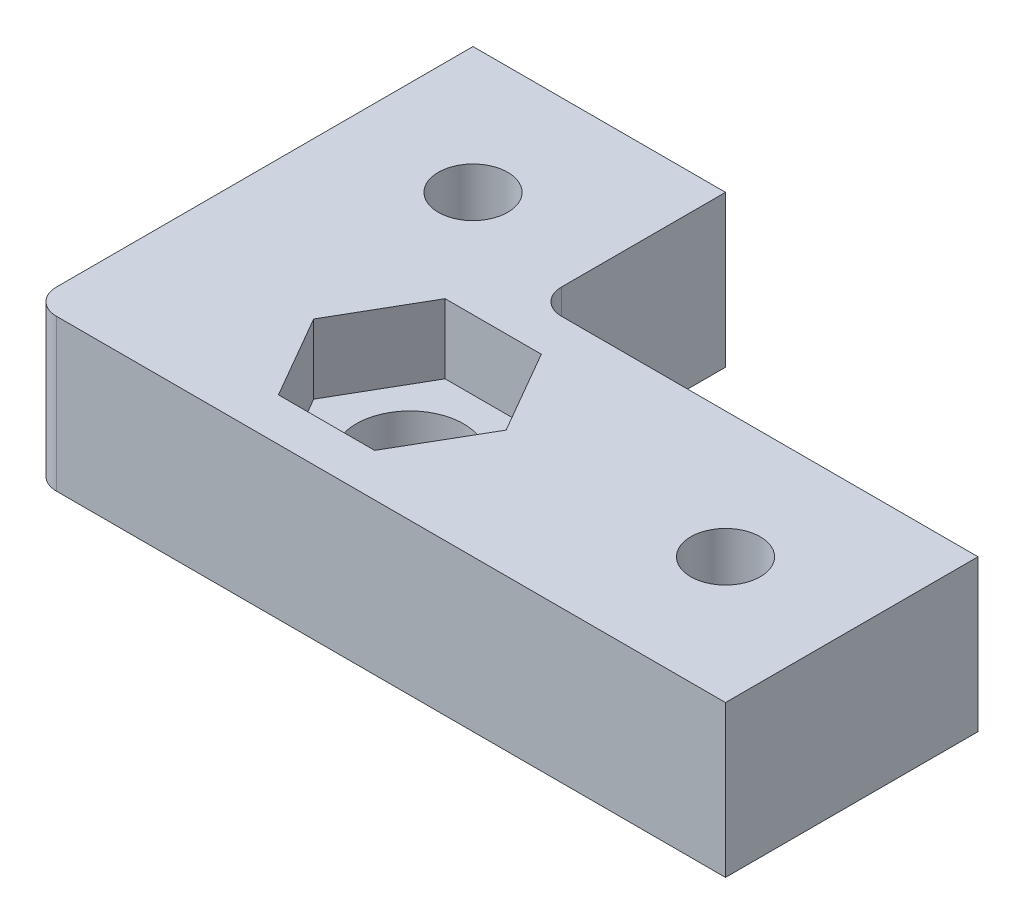
ISO-10303-21;
HEADER;
FILE_DESCRIPTION(('STEP AP214'),'2;1');
FILE_NAME('part.step','',(''),(''),'','','');
FILE_SCHEMA(('AUTOMOTIVE_DESIGN { 1 0 10303 214 1 1 1 1 }'));
ENDSEC;
DATA;
#1=APPLICATION_CONTEXT('core data for automotive mechanical design processes');
#2=APPLICATION_PROTOCOL_DEFINITION('international standard','automotive_design',2000,#1);
#3=PRODUCT_CONTEXT('',#1,'mechanical');
#4=PRODUCT('Part','Part','',(#3));
#5=PRODUCT_RELATED_PRODUCT_CATEGORY('part','',(#4));
#6=PRODUCT_DEFINITION_FORMATION('','',#4);
#7=PRODUCT_DEFINITION_CONTEXT('part definition',#1,'design');
#8=PRODUCT_DEFINITION('design','',#6,#7);
#9=PRODUCT_DEFINITION_SHAPE('','',#8);
#10=(LENGTH_UNIT() NAMED_UNIT(*) SI_UNIT(.MILLI.,.METRE.));
#11=(NAMED_UNIT(*) PLANE_ANGLE_UNIT() SI_UNIT($,.RADIAN.));
#12=(NAMED_UNIT(*) SI_UNIT($,.STERADIAN.) SOLID_ANGLE_UNIT());
#13=UNCERTAINTY_MEASURE_WITH_UNIT(LENGTH_MEASURE(1.E-05),#10,'distance_accuracy_value','');
#14=(GEOMETRIC_REPRESENTATION_CONTEXT(3) GLOBAL_UNCERTAINTY_ASSIGNED_CONTEXT((#13)) GLOBAL_UNIT_ASSIGNED_CONTEXT((#10,
#11,#12)) REPRESENTATION_CONTEXT('',''));
#15=CARTESIAN_POINT('',(0.,0.,0.));
#16=DIRECTION('',(0.,0.,1.));
#17=DIRECTION('',(1.,0.,0.));
#18=AXIS2_PLACEMENT_3D('',#15,#16,#17);
#19=CARTESIAN_POINT('',(0.,12.,0.));
#20=DIRECTION('',(0.,-1.,0.));
#21=DIRECTION('',(0.,0.,-1.));
#22=AXIS2_PLACEMENT_3D('',#19,#20,#21);
#23=PLANE('',#22);
#24=CARTESIAN_POINT('',(50.,12.,-15.));
#25=DIRECTION('',(0.,1.,0.));
#26=DIRECTION('',(0.,0.,1.));
#27=AXIS2_PLACEMENT_3D('',#24,#25,#26);
#28=CIRCLE('',#27,2.75);
#29=CARTESIAN_POINT('',(50.,12.,-12.25));
#30=VERTEX_POINT('',#29);
#31=EDGE_CURVE('E367',#30,#30,#28,.T.);
#32=ORIENTED_EDGE('',*,*,#31,.F.);
#33=EDGE_LOOP('',(#32));
#34=FACE_BOUND('',#33,.T.);
#35=CARTESIAN_POINT('',(15.,12.,-30.));
#36=DIRECTION('',(0.,1.,0.));
#37=DIRECTION('',(0.,0.,1.));
#38=AXIS2_PLACEMENT_3D('',#35,#36,#37);
#39=CIRCLE('',#38,2.75);
#40=CARTESIAN_POINT('',(15.,12.,-27.25));
#41=VERTEX_POINT('',#40);
#42=EDGE_CURVE('E164',#41,#41,#39,.T.);
#43=ORIENTED_EDGE('',*,*,#42,.F.);
#44=EDGE_LOOP('',(#43));
#45=FACE_BOUND('',#44,.T.);
#46=DIRECTION('',(-0.5,0.,-0.866025403784439));
#47=VECTOR('',#46,1.);
#48=CARTESIAN_POINT('',(32.6210235533031,12.,-15.));
#49=LINE('',#48,#47);
#50=CARTESIAN_POINT('',(32.6210235533031,12.,-15.));
#51=VERTEX_POINT('',#50);
#52=CARTESIAN_POINT('',(28.8105117766515,12.,-21.6));
#53=VERTEX_POINT('',#52);
#54=EDGE_CURVE('E200',#51,#53,#49,.T.);
#55=ORIENTED_EDGE('',*,*,#54,.F.);
#56=DIRECTION('',(0.499999999999999,0.,-0.866025403784439));
#57=VECTOR('',#56,1.);
#58=CARTESIAN_POINT('',(28.8105117766515,12.,-8.39999999999999));
#59=LINE('',#58,#57);
#60=CARTESIAN_POINT('',(28.8105117766515,12.,-8.39999999999999));
#61=VERTEX_POINT('',#60);
#62=EDGE_CURVE('E178',#61,#51,#59,.T.);
#63=ORIENTED_EDGE('',*,*,#62,.F.);
#64=DIRECTION('',(1.,0.,0.));
#65=VECTOR('',#64,1.);
#66=CARTESIAN_POINT('',(21.1894882233485,12.,-8.39999999999999));
#67=LINE('',#66,#65);
#68=CARTESIAN_POINT('',(21.1894882233485,12.,-8.39999999999999));
#69=VERTEX_POINT('',#68);
#70=EDGE_CURVE('E183',#69,#61,#67,.T.);
#71=ORIENTED_EDGE('',*,*,#70,.F.);
#72=DIRECTION('',(0.5,0.,0.866025403784438));
#73=VECTOR('',#72,1.);
#74=CARTESIAN_POINT('',(17.3789764466969,12.,-15.));
#75=LINE('',#74,#73);
#76=CARTESIAN_POINT('',(17.3789764466969,12.,-15.));
#77=VERTEX_POINT('',#76);
#78=EDGE_CURVE('E209',#77,#69,#75,.T.);
#79=ORIENTED_EDGE('',*,*,#78,.F.);
#80=DIRECTION('',(-0.499999999999999,0.,0.866025403784439));
#81=VECTOR('',#80,1.);
#82=CARTESIAN_POINT('',(21.1894882233485,12.,-21.6));
#83=LINE('',#82,#81);
#84=CARTESIAN_POINT('',(21.1894882233485,12.,-21.6));
#85=VERTEX_POINT('',#84);
#86=EDGE_CURVE('E206',#85,#77,#83,.T.);
#87=ORIENTED_EDGE('',*,*,#86,.F.);
#88=DIRECTION('',(-1.,0.,0.));
#89=VECTOR('',#88,1.);
#90=CARTESIAN_POINT('',(28.8105117766515,12.,-21.6));
#91=LINE('',#90,#89);
#92=EDGE_CURVE('E203',#53,#85,#91,.T.);
#93=ORIENTED_EDGE('',*,*,#92,.F.);
#94=EDGE_LOOP('',(#55,#63,#71,#79,#87,#93));
#95=FACE_BOUND('',#94,.T.);
#96=DIRECTION('',(0.,0.,1.));
#97=VECTOR('',#96,1.);
#98=CARTESIAN_POINT('',(5.00000000000001,12.,-40.));
#99=LINE('',#98,#97);
#100=CARTESIAN_POINT('',(5.00000000000001,12.,-40.));
#101=VERTEX_POINT('',#100);
#102=CARTESIAN_POINT('',(5.00000000000001,12.,-7.));
#103=VERTEX_POINT('',#102);
#104=EDGE_CURVE('E151',#101,#103,#99,.T.);
#105=ORIENTED_EDGE('',*,*,#104,.T.);
#106=CARTESIAN_POINT('',(7.00000000000001,12.,-7.));
#107=DIRECTION('',(0.,-1.,0.));
#108=DIRECTION('',(0.,0.,-1.));
#109=AXIS2_PLACEMENT_3D('',#106,#107,#108);
#110=CIRCLE('',#109,2.);
#111=CARTESIAN_POINT('',(7.00000000000001,12.,-5.));
#112=VERTEX_POINT('',#111);
#113=EDGE_CURVE('E55',#103,#112,#110,.F.);
#114=ORIENTED_EDGE('',*,*,#113,.T.);
#115=DIRECTION('',(1.,0.,0.));
#116=VECTOR('',#115,1.);
#117=CARTESIAN_POINT('',(5.00000000000001,12.,-5.));
#118=LINE('',#117,#116);
#119=CARTESIAN_POINT('',(60.,12.,-5.));
#120=VERTEX_POINT('',#119);
#121=EDGE_CURVE('E169',#112,#120,#118,.T.);
#122=ORIENTED_EDGE('',*,*,#121,.T.);
#123=DIRECTION('',(0.,0.,-1.));
#124=VECTOR('',#123,1.);
#125=CARTESIAN_POINT('',(60.,12.,-5.));
#126=LINE('',#125,#124);
#127=CARTESIAN_POINT('',(60.,12.,-25.));
#128=VERTEX_POINT('',#127);
#129=EDGE_CURVE('E161',#120,#128,#126,.T.);
#130=ORIENTED_EDGE('',*,*,#129,.T.);
#131=DIRECTION('',(-1.,0.,0.));
#132=VECTOR('',#131,1.);
#133=CARTESIAN_POINT('',(25.,12.,-25.));
#134=LINE('',#133,#132);
#135=CARTESIAN_POINT('',(27.,12.,-25.));
#136=VERTEX_POINT('',#135);
#137=EDGE_CURVE('E231',#128,#136,#134,.T.);
#138=ORIENTED_EDGE('',*,*,#137,.T.);
#139=CARTESIAN_POINT('',(27.,12.,-27.));
#140=DIRECTION('',(0.,-1.,0.));
#141=DIRECTION('',(0.,0.,-1.));
#142=AXIS2_PLACEMENT_3D('',#139,#140,#141);
#143=CIRCLE('',#142,2.);
#144=CARTESIAN_POINT('',(25.,12.,-27.));
#145=VERTEX_POINT('',#144);
#146=EDGE_CURVE('E250',#136,#145,#143,.T.);
#147=ORIENTED_EDGE('',*,*,#146,.T.);
#148=DIRECTION('',(0.,0.,-1.));
#149=VECTOR('',#148,1.);
#150=CARTESIAN_POINT('',(25.,12.,-65.));
#151=LINE('',#150,#149);
#152=CARTESIAN_POINT('',(25.,12.,-40.));
#153=VERTEX_POINT('',#152);
#154=EDGE_CURVE('E233',#145,#153,#151,.T.);
#155=ORIENTED_EDGE('',*,*,#154,.T.);
#156=DIRECTION('',(-1.,0.,0.));
#157=VECTOR('',#156,1.);
#158=CARTESIAN_POINT('',(60.,12.,-40.));
#159=LINE('',#158,#157);
#160=EDGE_CURVE('E158',#153,#101,#159,.T.);
#161=ORIENTED_EDGE('',*,*,#160,.T.);
#162=EDGE_LOOP('',(#105,#114,#122,#130,#138,#147,#155,#161));
#163=FACE_BOUND('',#162,.T.);
#164=ADVANCED_FACE('F33',(#34,#45,#95,#163),#23,.F.);
#165=CARTESIAN_POINT('',(25.,12.,-25.));
#166=DIRECTION('',(0.,0.,1.));
#167=DIRECTION('',(1.,0.,0.));
#168=AXIS2_PLACEMENT_3D('',#165,#166,#167);
#169=PLANE('',#168);
#170=DIRECTION('',(0.,1.,0.));
#171=VECTOR('',#170,1.);
#172=CARTESIAN_POINT('',(60.,12.,-25.));
#173=LINE('',#172,#171);
#174=CARTESIAN_POINT('',(60.,0.,-25.));
#175=VERTEX_POINT('',#174);
#176=EDGE_CURVE('E153',#175,#128,#173,.T.);
#177=ORIENTED_EDGE('',*,*,#176,.F.);
#178=DIRECTION('',(-1.,0.,0.));
#179=VECTOR('',#178,1.);
#180=CARTESIAN_POINT('',(25.,0.,-25.));
#181=LINE('',#180,#179);
#182=CARTESIAN_POINT('',(27.,0.,-25.));
#183=VERTEX_POINT('',#182);
#184=EDGE_CURVE('E230',#175,#183,#181,.T.);
#185=ORIENTED_EDGE('',*,*,#184,.T.);
#186=DIRECTION('',(0.,-1.,0.));
#187=VECTOR('',#186,1.);
#188=CARTESIAN_POINT('',(27.,12.,-25.));
#189=LINE('',#188,#187);
#190=EDGE_CURVE('E244',#183,#136,#189,.F.);
#191=ORIENTED_EDGE('',*,*,#190,.T.);
#192=ORIENTED_EDGE('',*,*,#137,.F.);
#193=EDGE_LOOP('',(#177,#185,#191,#192));
#194=FACE_BOUND('',#193,.T.);
#195=ADVANCED_FACE('F268',(#194),#169,.F.);
#196=CARTESIAN_POINT('',(25.,12.,-65.));
#197=DIRECTION('',(-1.,0.,0.));
#198=DIRECTION('',(0.,0.,1.));
#199=AXIS2_PLACEMENT_3D('',#196,#197,#198);
#200=PLANE('',#199);
#201=DIRECTION('',(0.,-1.,0.));
#202=VECTOR('',#201,1.);
#203=CARTESIAN_POINT('',(25.,12.,-40.));
#204=LINE('',#203,#202);
#205=CARTESIAN_POINT('',(25.,0.,-40.));
#206=VERTEX_POINT('',#205);
#207=EDGE_CURVE('E137',#153,#206,#204,.T.);
#208=ORIENTED_EDGE('',*,*,#207,.F.);
#209=ORIENTED_EDGE('',*,*,#154,.F.);
#210=DIRECTION('',(0.,-1.,0.));
#211=VECTOR('',#210,1.);
#212=CARTESIAN_POINT('',(25.,0.,-27.));
#213=LINE('',#212,#211);
#214=CARTESIAN_POINT('',(25.,0.,-27.));
#215=VERTEX_POINT('',#214);
#216=EDGE_CURVE('E237',#145,#215,#213,.T.);
#217=ORIENTED_EDGE('',*,*,#216,.T.);
#218=DIRECTION('',(0.,0.,-1.));
#219=VECTOR('',#218,1.);
#220=CARTESIAN_POINT('',(25.,0.,-65.));
#221=LINE('',#220,#219);
#222=EDGE_CURVE('E234',#215,#206,#221,.T.);
#223=ORIENTED_EDGE('',*,*,#222,.T.);
#224=EDGE_LOOP('',(#208,#209,#217,#223));
#225=FACE_BOUND('',#224,.T.);
#226=ADVANCED_FACE('F257',(#225),#200,.F.);
#227=CARTESIAN_POINT('',(0.,0.,0.));
#228=DIRECTION('',(0.,-1.,0.));
#229=DIRECTION('',(0.,0.,-1.));
#230=AXIS2_PLACEMENT_3D('',#227,#228,#229);
#231=PLANE('',#230);
#232=CARTESIAN_POINT('',(50.,0.,-15.));
#233=DIRECTION('',(0.,1.,0.));
#234=DIRECTION('',(0.,0.,1.));
#235=AXIS2_PLACEMENT_3D('',#232,#233,#234);
#236=CIRCLE('',#235,2.75);
#237=CARTESIAN_POINT('',(50.,0.,-12.25));
#238=VERTEX_POINT('',#237);
#239=EDGE_CURVE('E365',#238,#238,#236,.T.);
#240=ORIENTED_EDGE('',*,*,#239,.T.);
#241=EDGE_LOOP('',(#240));
#242=FACE_BOUND('',#241,.T.);
#243=CARTESIAN_POINT('',(15.,0.,-30.));
#244=DIRECTION('',(0.,1.,0.));
#245=DIRECTION('',(0.,0.,1.));
#246=AXIS2_PLACEMENT_3D('',#243,#244,#245);
#247=CIRCLE('',#246,2.75);
#248=CARTESIAN_POINT('',(15.,0.,-27.25));
#249=VERTEX_POINT('',#248);
#250=EDGE_CURVE('E170',#249,#249,#247,.T.);
#251=ORIENTED_EDGE('',*,*,#250,.T.);
#252=EDGE_LOOP('',(#251));
#253=FACE_BOUND('',#252,.T.);
#254=CARTESIAN_POINT('',(25.,0.,-15.));
#255=DIRECTION('',(0.,1.,0.));
#256=DIRECTION('',(0.,0.,1.));
#257=AXIS2_PLACEMENT_3D('',#254,#255,#256);
#258=CIRCLE('',#257,4.25);
#259=CARTESIAN_POINT('',(25.,0.,-10.75));
#260=VERTEX_POINT('',#259);
#261=EDGE_CURVE('E227',#260,#260,#258,.T.);
#262=ORIENTED_EDGE('',*,*,#261,.T.);
#263=EDGE_LOOP('',(#262));
#264=FACE_BOUND('',#263,.T.);
#265=DIRECTION('',(1.,0.,0.));
#266=VECTOR('',#265,1.);
#267=CARTESIAN_POINT('',(5.00000000000001,0.,-5.));
#268=LINE('',#267,#266);
#269=CARTESIAN_POINT('',(7.00000000000001,0.,-5.));
#270=VERTEX_POINT('',#269);
#271=CARTESIAN_POINT('',(60.,0.,-5.));
#272=VERTEX_POINT('',#271);
#273=EDGE_CURVE('E157',#270,#272,#268,.T.);
#274=ORIENTED_EDGE('',*,*,#273,.F.);
#275=CARTESIAN_POINT('',(7.00000000000001,0.,-7.));
#276=DIRECTION('',(0.,-1.,0.));
#277=DIRECTION('',(0.,0.,-1.));
#278=AXIS2_PLACEMENT_3D('',#275,#276,#277);
#279=CIRCLE('',#278,2.);
#280=CARTESIAN_POINT('',(5.00000000000001,0.,-7.));
#281=VERTEX_POINT('',#280);
#282=EDGE_CURVE('E12',#270,#281,#279,.T.);
#283=ORIENTED_EDGE('',*,*,#282,.T.);
#284=DIRECTION('',(0.,0.,1.));
#285=VECTOR('',#284,1.);
#286=CARTESIAN_POINT('',(5.00000000000001,0.,-40.));
#287=LINE('',#286,#285);
#288=CARTESIAN_POINT('',(5.00000000000001,0.,-40.));
#289=VERTEX_POINT('',#288);
#290=EDGE_CURVE('E149',#289,#281,#287,.T.);
#291=ORIENTED_EDGE('',*,*,#290,.F.);
#292=DIRECTION('',(-1.,0.,0.));
#293=VECTOR('',#292,1.);
#294=CARTESIAN_POINT('',(60.,0.,-40.));
#295=LINE('',#294,#293);
#296=EDGE_CURVE('E131',#206,#289,#295,.T.);
#297=ORIENTED_EDGE('',*,*,#296,.F.);
#298=ORIENTED_EDGE('',*,*,#222,.F.);
#299=CARTESIAN_POINT('',(27.,0.,-27.));
#300=DIRECTION('',(0.,-1.,0.));
#301=DIRECTION('',(0.,0.,-1.));
#302=AXIS2_PLACEMENT_3D('',#299,#300,#301);
#303=CIRCLE('',#302,2.);
#304=EDGE_CURVE('E247',#215,#183,#303,.F.);
#305=ORIENTED_EDGE('',*,*,#304,.T.);
#306=ORIENTED_EDGE('',*,*,#184,.F.);
#307=DIRECTION('',(0.,0.,-1.));
#308=VECTOR('',#307,1.);
#309=CARTESIAN_POINT('',(60.,0.,-5.));
#310=LINE('',#309,#308);
#311=EDGE_CURVE('E143',#272,#175,#310,.T.);
#312=ORIENTED_EDGE('',*,*,#311,.F.);
#313=EDGE_LOOP('',(#274,#283,#291,#297,#298,#305,#306,#312));
#314=FACE_BOUND('',#313,.T.);
#315=ADVANCED_FACE('F155',(#242,#253,#264,#314),#231,.T.);
#316=CARTESIAN_POINT('',(25.,0.,-15.));
#317=DIRECTION('',(0.,1.,0.));
#318=DIRECTION('',(0.,0.,1.));
#319=AXIS2_PLACEMENT_3D('',#316,#317,#318);
#320=CYLINDRICAL_SURFACE('',#319,4.25);
#321=ORIENTED_EDGE('',*,*,#261,.F.);
#322=EDGE_LOOP('',(#321));
#323=FACE_BOUND('',#322,.T.);
#324=CARTESIAN_POINT('',(25.,6.5,-15.));
#325=DIRECTION('',(0.,1.,0.));
#326=DIRECTION('',(0.,0.,1.));
#327=AXIS2_PLACEMENT_3D('',#324,#325,#326);
#328=CIRCLE('',#327,4.25);
#329=CARTESIAN_POINT('',(25.,6.5,-10.75));
#330=VERTEX_POINT('',#329);
#331=EDGE_CURVE('E216',#330,#330,#328,.F.);
#332=ORIENTED_EDGE('',*,*,#331,.F.);
#333=EDGE_LOOP('',(#332));
#334=FACE_BOUND('',#333,.T.);
#335=ADVANCED_FACE('F295',(#323,#334),#320,.F.);
#336=CARTESIAN_POINT('',(0.,6.5,0.));
#337=DIRECTION('',(0.,1.,0.));
#338=DIRECTION('',(0.,0.,1.));
#339=AXIS2_PLACEMENT_3D('',#336,#337,#338);
#340=PLANE('',#339);
#341=DIRECTION('',(0.499999999999999,0.,-0.866025403784439));
#342=VECTOR('',#341,1.);
#343=CARTESIAN_POINT('',(28.8105117766515,6.5,-8.39999999999999));
#344=LINE('',#343,#342);
#345=CARTESIAN_POINT('',(28.8105117766515,6.5,-8.39999999999999));
#346=VERTEX_POINT('',#345);
#347=CARTESIAN_POINT('',(32.6210235533031,6.5,-15.));
#348=VERTEX_POINT('',#347);
#349=EDGE_CURVE('E179',#346,#348,#344,.T.);
#350=ORIENTED_EDGE('',*,*,#349,.T.);
#351=DIRECTION('',(-0.5,0.,-0.866025403784439));
#352=VECTOR('',#351,1.);
#353=CARTESIAN_POINT('',(32.6210235533031,6.5,-15.));
#354=LINE('',#353,#352);
#355=CARTESIAN_POINT('',(28.8105117766515,6.5,-21.6));
#356=VERTEX_POINT('',#355);
#357=EDGE_CURVE('E182',#348,#356,#354,.T.);
#358=ORIENTED_EDGE('',*,*,#357,.T.);
#359=DIRECTION('',(-1.,0.,0.));
#360=VECTOR('',#359,1.);
#361=CARTESIAN_POINT('',(28.8105117766515,6.5,-21.6));
#362=LINE('',#361,#360);
#363=CARTESIAN_POINT('',(21.1894882233485,6.5,-21.6));
#364=VERTEX_POINT('',#363);
#365=EDGE_CURVE('E186',#356,#364,#362,.T.);
#366=ORIENTED_EDGE('',*,*,#365,.T.);
#367=DIRECTION('',(-0.499999999999999,0.,0.866025403784439));
#368=VECTOR('',#367,1.);
#369=CARTESIAN_POINT('',(21.1894882233485,6.5,-21.6));
#370=LINE('',#369,#368);
#371=CARTESIAN_POINT('',(17.3789764466969,6.5,-15.));
#372=VERTEX_POINT('',#371);
#373=EDGE_CURVE('E189',#364,#372,#370,.T.);
#374=ORIENTED_EDGE('',*,*,#373,.T.);
#375=DIRECTION('',(0.5,0.,0.866025403784438));
#376=VECTOR('',#375,1.);
#377=CARTESIAN_POINT('',(17.3789764466969,6.5,-15.));
#378=LINE('',#377,#376);
#379=CARTESIAN_POINT('',(21.1894882233485,6.5,-8.39999999999999));
#380=VERTEX_POINT('',#379);
#381=EDGE_CURVE('E192',#372,#380,#378,.T.);
#382=ORIENTED_EDGE('',*,*,#381,.T.);
#383=DIRECTION('',(1.,0.,0.));
#384=VECTOR('',#383,1.);
#385=CARTESIAN_POINT('',(21.1894882233485,6.5,-8.39999999999999));
#386=LINE('',#385,#384);
#387=EDGE_CURVE('E195',#380,#346,#386,.T.);
#388=ORIENTED_EDGE('',*,*,#387,.T.);
#389=EDGE_LOOP('',(#350,#358,#366,#374,#382,#388));
#390=FACE_BOUND('',#389,.T.);
#391=ORIENTED_EDGE('',*,*,#331,.T.);
#392=EDGE_LOOP('',(#391));
#393=FACE_BOUND('',#392,.T.);
#394=ADVANCED_FACE('F321',(#390,#393),#340,.T.);
#395=CARTESIAN_POINT('',(28.8105117766515,6.5,-8.39999999999999));
#396=DIRECTION('',(0.866025403784439,0.,0.499999999999999));
#397=DIRECTION('',(0.499999999999999,0.,-0.866025403784439));
#398=AXIS2_PLACEMENT_3D('',#395,#396,#397);
#399=PLANE('',#398);
#400=ORIENTED_EDGE('',*,*,#62,.T.);
#401=DIRECTION('',(0.,1.,0.));
#402=VECTOR('',#401,1.);
#403=CARTESIAN_POINT('',(32.6210235533031,6.5,-15.));
#404=LINE('',#403,#402);
#405=EDGE_CURVE('E198',#348,#51,#404,.T.);
#406=ORIENTED_EDGE('',*,*,#405,.F.);
#407=ORIENTED_EDGE('',*,*,#349,.F.);
#408=DIRECTION('',(0.,1.,0.));
#409=VECTOR('',#408,1.);
#410=CARTESIAN_POINT('',(28.8105117766515,6.5,-8.39999999999999));
#411=LINE('',#410,#409);
#412=EDGE_CURVE('E214',#346,#61,#411,.T.);
#413=ORIENTED_EDGE('',*,*,#412,.T.);
#414=EDGE_LOOP('',(#400,#406,#407,#413));
#415=FACE_BOUND('',#414,.T.);
#416=ADVANCED_FACE('F318',(#415),#399,.F.);
#417=CARTESIAN_POINT('',(21.1894882233485,6.5,-8.39999999999999));
#418=DIRECTION('',(0.,0.,1.));
#419=DIRECTION('',(1.,0.,0.));
#420=AXIS2_PLACEMENT_3D('',#417,#418,#419);
#421=PLANE('',#420);
#422=ORIENTED_EDGE('',*,*,#70,.T.);
#423=ORIENTED_EDGE('',*,*,#412,.F.);
#424=ORIENTED_EDGE('',*,*,#387,.F.);
#425=DIRECTION('',(0.,1.,0.));
#426=VECTOR('',#425,1.);
#427=CARTESIAN_POINT('',(21.1894882233485,6.5,-8.39999999999999));
#428=LINE('',#427,#426);
#429=EDGE_CURVE('E217',#380,#69,#428,.T.);
#430=ORIENTED_EDGE('',*,*,#429,.T.);
#431=EDGE_LOOP('',(#422,#423,#424,#430));
#432=FACE_BOUND('',#431,.T.);
#433=ADVANCED_FACE('F320',(#432),#421,.F.);
#434=CARTESIAN_POINT('',(17.3789764466969,6.5,-15.));
#435=DIRECTION('',(-0.866025403784438,0.,0.5));
#436=DIRECTION('',(0.5,0.,0.866025403784438));
#437=AXIS2_PLACEMENT_3D('',#434,#435,#436);
#438=PLANE('',#437);
#439=ORIENTED_EDGE('',*,*,#78,.T.);
#440=ORIENTED_EDGE('',*,*,#429,.F.);
#441=ORIENTED_EDGE('',*,*,#381,.F.);
#442=DIRECTION('',(0.,1.,0.));
#443=VECTOR('',#442,1.);
#444=CARTESIAN_POINT('',(17.3789764466969,6.5,-15.));
#445=LINE('',#444,#443);
#446=EDGE_CURVE('E219',#372,#77,#445,.T.);
#447=ORIENTED_EDGE('',*,*,#446,.T.);
#448=EDGE_LOOP('',(#439,#440,#441,#447));
#449=FACE_BOUND('',#448,.T.);
#450=ADVANCED_FACE('F327',(#449),#438,.F.);
#451=CARTESIAN_POINT('',(21.1894882233485,6.5,-21.6));
#452=DIRECTION('',(-0.866025403784439,0.,-0.499999999999999));
#453=DIRECTION('',(-0.499999999999999,0.,0.866025403784439));
#454=AXIS2_PLACEMENT_3D('',#451,#452,#453);
#455=PLANE('',#454);
#456=ORIENTED_EDGE('',*,*,#86,.T.);
#457=ORIENTED_EDGE('',*,*,#446,.F.);
#458=ORIENTED_EDGE('',*,*,#373,.F.);
#459=DIRECTION('',(0.,1.,0.));
#460=VECTOR('',#459,1.);
#461=CARTESIAN_POINT('',(21.1894882233485,6.5,-21.6));
#462=LINE('',#461,#460);
#463=EDGE_CURVE('E221',#364,#85,#462,.T.);
#464=ORIENTED_EDGE('',*,*,#463,.T.);
#465=EDGE_LOOP('',(#456,#457,#458,#464));
#466=FACE_BOUND('',#465,.T.);
#467=ADVANCED_FACE('F314',(#466),#455,.F.);
#468=CARTESIAN_POINT('',(28.8105117766515,6.5,-21.6));
#469=DIRECTION('',(0.,0.,-1.));
#470=DIRECTION('',(-1.,0.,0.));
#471=AXIS2_PLACEMENT_3D('',#468,#469,#470);
#472=PLANE('',#471);
#473=ORIENTED_EDGE('',*,*,#92,.T.);
#474=ORIENTED_EDGE('',*,*,#463,.F.);
#475=ORIENTED_EDGE('',*,*,#365,.F.);
#476=DIRECTION('',(0.,1.,0.));
#477=VECTOR('',#476,1.);
#478=CARTESIAN_POINT('',(28.8105117766515,6.5,-21.6));
#479=LINE('',#478,#477);
#480=EDGE_CURVE('E223',#356,#53,#479,.T.);
#481=ORIENTED_EDGE('',*,*,#480,.T.);
#482=EDGE_LOOP('',(#473,#474,#475,#481));
#483=FACE_BOUND('',#482,.T.);
#484=ADVANCED_FACE('F308',(#483),#472,.F.);
#485=CARTESIAN_POINT('',(32.6210235533031,6.5,-15.));
#486=DIRECTION('',(0.866025403784438,0.,-0.5));
#487=DIRECTION('',(-0.5,0.,-0.866025403784439));
#488=AXIS2_PLACEMENT_3D('',#485,#486,#487);
#489=PLANE('',#488);
#490=ORIENTED_EDGE('',*,*,#54,.T.);
#491=ORIENTED_EDGE('',*,*,#480,.F.);
#492=ORIENTED_EDGE('',*,*,#357,.F.);
#493=ORIENTED_EDGE('',*,*,#405,.T.);
#494=EDGE_LOOP('',(#490,#491,#492,#493));
#495=FACE_BOUND('',#494,.T.);
#496=ADVANCED_FACE('F302',(#495),#489,.F.);
#497=CARTESIAN_POINT('',(27.,12.,-27.));
#498=DIRECTION('',(0.,1.,0.));
#499=DIRECTION('',(0.,0.,1.));
#500=AXIS2_PLACEMENT_3D('',#497,#498,#499);
#501=CYLINDRICAL_SURFACE('',#500,2.);
#502=ORIENTED_EDGE('',*,*,#146,.F.);
#503=ORIENTED_EDGE('',*,*,#190,.F.);
#504=ORIENTED_EDGE('',*,*,#304,.F.);
#505=ORIENTED_EDGE('',*,*,#216,.F.);
#506=EDGE_LOOP('',(#502,#503,#504,#505));
#507=FACE_BOUND('',#506,.T.);
#508=ADVANCED_FACE('F264',(#507),#501,.F.);
#509=CARTESIAN_POINT('',(60.,0.,-40.));
#510=DIRECTION('',(0.,0.,-1.));
#511=DIRECTION('',(-1.,0.,0.));
#512=AXIS2_PLACEMENT_3D('',#509,#510,#511);
#513=PLANE('',#512);
#514=ORIENTED_EDGE('',*,*,#207,.T.);
#515=ORIENTED_EDGE('',*,*,#296,.T.);
#516=DIRECTION('',(0.,1.,0.));
#517=VECTOR('',#516,1.);
#518=CARTESIAN_POINT('',(5.00000000000001,0.,-40.));
#519=LINE('',#518,#517);
#520=EDGE_CURVE('E134',#289,#101,#519,.T.);
#521=ORIENTED_EDGE('',*,*,#520,.T.);
#522=ORIENTED_EDGE('',*,*,#160,.F.);
#523=EDGE_LOOP('',(#514,#515,#521,#522));
#524=FACE_BOUND('',#523,.T.);
#525=ADVANCED_FACE('F133',(#524),#513,.T.);
#526=CARTESIAN_POINT('',(60.,0.,-5.));
#527=DIRECTION('',(1.,0.,0.));
#528=DIRECTION('',(0.,0.,-1.));
#529=AXIS2_PLACEMENT_3D('',#526,#527,#528);
#530=PLANE('',#529);
#531=ORIENTED_EDGE('',*,*,#176,.T.);
#532=ORIENTED_EDGE('',*,*,#129,.F.);
#533=DIRECTION('',(0.,1.,0.));
#534=VECTOR('',#533,1.);
#535=CARTESIAN_POINT('',(60.,0.,-5.));
#536=LINE('',#535,#534);
#537=EDGE_CURVE('E142',#272,#120,#536,.T.);
#538=ORIENTED_EDGE('',*,*,#537,.F.);
#539=ORIENTED_EDGE('',*,*,#311,.T.);
#540=EDGE_LOOP('',(#531,#532,#538,#539));
#541=FACE_BOUND('',#540,.T.);
#542=ADVANCED_FACE('F271',(#541),#530,.T.);
#543=CARTESIAN_POINT('',(5.00000000000001,0.,-40.));
#544=DIRECTION('',(-1.,0.,0.));
#545=DIRECTION('',(0.,0.,1.));
#546=AXIS2_PLACEMENT_3D('',#543,#544,#545);
#547=PLANE('',#546);
#548=ORIENTED_EDGE('',*,*,#290,.T.);
#549=DIRECTION('',(0.,1.,0.));
#550=VECTOR('',#549,1.);
#551=CARTESIAN_POINT('',(5.00000000000001,0.,-7.));
#552=LINE('',#551,#550);
#553=EDGE_CURVE('E252',#281,#103,#552,.T.);
#554=ORIENTED_EDGE('',*,*,#553,.T.);
#555=ORIENTED_EDGE('',*,*,#104,.F.);
#556=ORIENTED_EDGE('',*,*,#520,.F.);
#557=EDGE_LOOP('',(#548,#554,#555,#556));
#558=FACE_BOUND('',#557,.T.);
#559=ADVANCED_FACE('F147',(#558),#547,.T.);
#560=CARTESIAN_POINT('',(5.00000000000001,0.,-5.));
#561=DIRECTION('',(0.,0.,1.));
#562=DIRECTION('',(1.,0.,0.));
#563=AXIS2_PLACEMENT_3D('',#560,#561,#562);
#564=PLANE('',#563);
#565=ORIENTED_EDGE('',*,*,#121,.F.);
#566=DIRECTION('',(0.,1.,0.));
#567=VECTOR('',#566,1.);
#568=CARTESIAN_POINT('',(7.00000000000001,0.,-5.));
#569=LINE('',#568,#567);
#570=EDGE_CURVE('E41',#112,#270,#569,.F.);
#571=ORIENTED_EDGE('',*,*,#570,.T.);
#572=ORIENTED_EDGE('',*,*,#273,.T.);
#573=ORIENTED_EDGE('',*,*,#537,.T.);
#574=EDGE_LOOP('',(#565,#571,#572,#573));
#575=FACE_BOUND('',#574,.T.);
#576=ADVANCED_FACE('F273',(#575),#564,.T.);
#577=CARTESIAN_POINT('',(7.00000000000001,0.,-7.));
#578=DIRECTION('',(0.,1.,0.));
#579=DIRECTION('',(0.,0.,1.));
#580=AXIS2_PLACEMENT_3D('',#577,#578,#579);
#581=CYLINDRICAL_SURFACE('',#580,2.);
#582=ORIENTED_EDGE('',*,*,#282,.F.);
#583=ORIENTED_EDGE('',*,*,#570,.F.);
#584=ORIENTED_EDGE('',*,*,#113,.F.);
#585=ORIENTED_EDGE('',*,*,#553,.F.);
#586=EDGE_LOOP('',(#582,#583,#584,#585));
#587=FACE_BOUND('',#586,.T.);
#588=ADVANCED_FACE('F35',(#587),#581,.T.);
#589=CARTESIAN_POINT('',(15.,0.,-30.));
#590=DIRECTION('',(0.,1.,0.));
#591=DIRECTION('',(0.,0.,1.));
#592=AXIS2_PLACEMENT_3D('',#589,#590,#591);
#593=CYLINDRICAL_SURFACE('',#592,2.75);
#594=ORIENTED_EDGE('',*,*,#250,.F.);
#595=EDGE_LOOP('',(#594));
#596=FACE_BOUND('',#595,.T.);
#597=ORIENTED_EDGE('',*,*,#42,.T.);
#598=EDGE_LOOP('',(#597));
#599=FACE_BOUND('',#598,.T.);
#600=ADVANCED_FACE('F275',(#596,#599),#593,.F.);
#601=CARTESIAN_POINT('',(50.,0.,-15.));
#602=DIRECTION('',(0.,1.,0.));
#603=DIRECTION('',(0.,0.,1.));
#604=AXIS2_PLACEMENT_3D('',#601,#602,#603);
#605=CYLINDRICAL_SURFACE('',#604,2.75);
#606=ORIENTED_EDGE('',*,*,#239,.F.);
#607=EDGE_LOOP('',(#606));
#608=FACE_BOUND('',#607,.T.);
#609=ORIENTED_EDGE('',*,*,#31,.T.);
#610=EDGE_LOOP('',(#609));
#611=FACE_BOUND('',#610,.T.);
#612=ADVANCED_FACE('F280',(#608,#611),#605,.F.);
#613=CLOSED_SHELL('',(#164,#195,#226,#315,#335,#394,#416,#433,#450,#467,#484,#496,#508,#525,
#542,#559,#576,#588,#600,#612));
#614=MANIFOLD_SOLID_BREP('B2',#613);
#615=ADVANCED_BREP_SHAPE_REPRESENTATION('',(#18,#614),#14);
#616=SHAPE_DEFINITION_REPRESENTATION(#9,#615);
ENDSEC;
END-ISO-10303-21;
